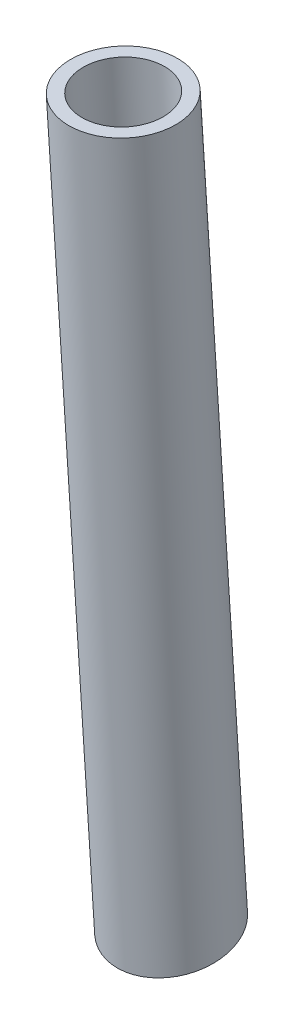
ISO-10303-21;
HEADER;
FILE_DESCRIPTION(('STEP AP214'),'2;1');
FILE_NAME('part.step','',(''),(''),'','','');
FILE_SCHEMA(('AUTOMOTIVE_DESIGN { 1 0 10303 214 1 1 1 1 }'));
ENDSEC;
DATA;
#1=APPLICATION_CONTEXT('core data for automotive mechanical design processes');
#2=APPLICATION_PROTOCOL_DEFINITION('international standard','automotive_design',2000,#1);
#3=PRODUCT_CONTEXT('',#1,'mechanical');
#4=PRODUCT('Part','Part','',(#3));
#5=PRODUCT_RELATED_PRODUCT_CATEGORY('part','',(#4));
#6=PRODUCT_DEFINITION_FORMATION('','',#4);
#7=PRODUCT_DEFINITION_CONTEXT('part definition',#1,'design');
#8=PRODUCT_DEFINITION('design','',#6,#7);
#9=PRODUCT_DEFINITION_SHAPE('','',#8);
#10=(LENGTH_UNIT() NAMED_UNIT(*) SI_UNIT(.MILLI.,.METRE.));
#11=(NAMED_UNIT(*) PLANE_ANGLE_UNIT() SI_UNIT($,.RADIAN.));
#12=(NAMED_UNIT(*) SI_UNIT($,.STERADIAN.) SOLID_ANGLE_UNIT());
#13=UNCERTAINTY_MEASURE_WITH_UNIT(LENGTH_MEASURE(1.E-05),#10,'distance_accuracy_value','');
#14=(GEOMETRIC_REPRESENTATION_CONTEXT(3) GLOBAL_UNCERTAINTY_ASSIGNED_CONTEXT((#13)) GLOBAL_UNIT_ASSIGNED_CONTEXT((#10,
#11,#12)) REPRESENTATION_CONTEXT('',''));
#15=CARTESIAN_POINT('',(0.,0.,0.));
#16=DIRECTION('',(0.,0.,1.));
#17=DIRECTION('',(1.,0.,0.));
#18=AXIS2_PLACEMENT_3D('',#15,#16,#17);
#19=CARTESIAN_POINT('',(899.196916053029,101.086343763392,238.011921297441));
#20=DIRECTION('',(0.00459360392302388,0.9976356448477,0.0685712690003063));
#21=DIRECTION('',(0.,0.068571992479684,-0.99764617066742));
#22=AXIS2_PLACEMENT_3D('',#19,#20,#21);
#23=CYLINDRICAL_SURFACE('',#22,9.64999999999998);
#24=CARTESIAN_POINT('',(900.,275.499546279119,249.999999999998));
#25=DIRECTION('',(0.00229816078025706,0.999408736415632,0.034305918339809));
#26=DIRECTION('',(0.0668008812398191,-0.0343828093108978,0.997173738467612));
#27=AXIS2_PLACEMENT_3D('',#24,#25,#26);
#28=ELLIPSE('',#27,9.65570906915421,9.64999999999998);
#29=CARTESIAN_POINT('',(900.645009874815,275.167555875433,259.628419510043));
#30=VERTEX_POINT('',#29);
#31=EDGE_CURVE('E50',#30,#30,#28,.T.);
#32=ORIENTED_EDGE('',*,*,#31,.T.);
#33=EDGE_LOOP('',(#32));
#34=FACE_BOUND('',#33,.T.);
#35=CARTESIAN_POINT('',(899.196916053029,101.086343763392,238.011921297441));
#36=DIRECTION('',(-0.00143638782424149,0.977156337317368,0.212516891635755));
#37=DIRECTION('',(0.0414428460712231,0.212392700268517,-0.976305193769943));
#38=AXIS2_PLACEMENT_3D('',#35,#36,#37);
#39=ELLIPSE('',#38,9.75326811540499,9.64999999999998);
#40=CARTESIAN_POINT('',(899.601119242227,103.157866714865,228.48975498014));
#41=VERTEX_POINT('',#40);
#42=EDGE_CURVE('E45',#41,#41,#39,.T.);
#43=ORIENTED_EDGE('',*,*,#42,.F.);
#44=EDGE_LOOP('',(#43));
#45=FACE_BOUND('',#44,.T.);
#46=ADVANCED_FACE('F41',(#34,#45),#23,.F.);
#47=CARTESIAN_POINT('',(899.196916053029,101.086343763392,238.011921297441));
#48=DIRECTION('',(0.00459360392302388,0.9976356448477,0.0685712690003063));
#49=DIRECTION('',(0.,0.068571992479684,-0.99764617066742));
#50=AXIS2_PLACEMENT_3D('',#47,#48,#49);
#51=CYLINDRICAL_SURFACE('',#50,12.7000000000001);
#52=CARTESIAN_POINT('',(900.,275.499546279119,249.999999999998));
#53=DIRECTION('',(0.00229816078025706,0.999408736415632,0.034305918339809));
#54=DIRECTION('',(0.0668008812398191,-0.0343828093108978,0.997173738467612));
#55=AXIS2_PLACEMENT_3D('',#52,#53,#54);
#56=ELLIPSE('',#55,12.7075134899751,12.7000000000001);
#57=CARTESIAN_POINT('',(900.848873099497,275.062626265978,262.671598733424));
#58=VERTEX_POINT('',#57);
#59=EDGE_CURVE('E56',#58,#58,#56,.T.);
#60=ORIENTED_EDGE('',*,*,#59,.F.);
#61=EDGE_LOOP('',(#60));
#62=FACE_BOUND('',#61,.T.);
#63=CARTESIAN_POINT('',(899.196916053029,101.086343763392,238.011921297441));
#64=DIRECTION('',(-0.00143638782424149,0.977156337317368,0.212516891635755));
#65=DIRECTION('',(0.0414428460712231,0.212392700268517,-0.976305193769943));
#66=AXIS2_PLACEMENT_3D('',#63,#64,#65);
#67=ELLIPSE('',#66,12.8359072606885,12.7000000000001);
#68=CARTESIAN_POINT('',(899.728872581818,103.812596766886,225.480158372081));
#69=VERTEX_POINT('',#68);
#70=EDGE_CURVE('E10',#69,#69,#67,.T.);
#71=ORIENTED_EDGE('',*,*,#70,.T.);
#72=EDGE_LOOP('',(#71));
#73=FACE_BOUND('',#72,.T.);
#74=ADVANCED_FACE('F72',(#62,#73),#51,.T.);
#75=CARTESIAN_POINT('',(899.999999999999,275.499546279119,249.999999999998));
#76=DIRECTION('',(-0.00229816078025706,-0.999408736415632,-0.034305918339809));
#77=DIRECTION('',(0.,-0.0343060089342588,0.999411375636181));
#78=AXIS2_PLACEMENT_3D('',#75,#76,#77);
#79=PLANE('',#78);
#80=ORIENTED_EDGE('',*,*,#31,.F.);
#81=EDGE_LOOP('',(#80));
#82=FACE_BOUND('',#81,.T.);
#83=ORIENTED_EDGE('',*,*,#59,.T.);
#84=EDGE_LOOP('',(#83));
#85=FACE_BOUND('',#84,.T.);
#86=ADVANCED_FACE('F78',(#82,#85),#79,.F.);
#87=CARTESIAN_POINT('',(899.196916053029,101.086343763392,238.011921297441));
#88=DIRECTION('',(0.00143638782424149,-0.977156337317368,-0.212516891635755));
#89=DIRECTION('',(0.,-0.21251711086958,0.977157345358283));
#90=AXIS2_PLACEMENT_3D('',#87,#88,#89);
#91=PLANE('',#90);
#92=ORIENTED_EDGE('',*,*,#42,.T.);
#93=EDGE_LOOP('',(#92));
#94=FACE_BOUND('',#93,.T.);
#95=ORIENTED_EDGE('',*,*,#70,.F.);
#96=EDGE_LOOP('',(#95));
#97=FACE_BOUND('',#96,.T.);
#98=ADVANCED_FACE('F43',(#94,#97),#91,.T.);
#99=CLOSED_SHELL('',(#46,#74,#86,#98));
#100=MANIFOLD_SOLID_BREP('B2',#99);
#101=ADVANCED_BREP_SHAPE_REPRESENTATION('',(#18,#100),#14);
#102=SHAPE_DEFINITION_REPRESENTATION(#9,#101);
ENDSEC;
END-ISO-10303-21;
